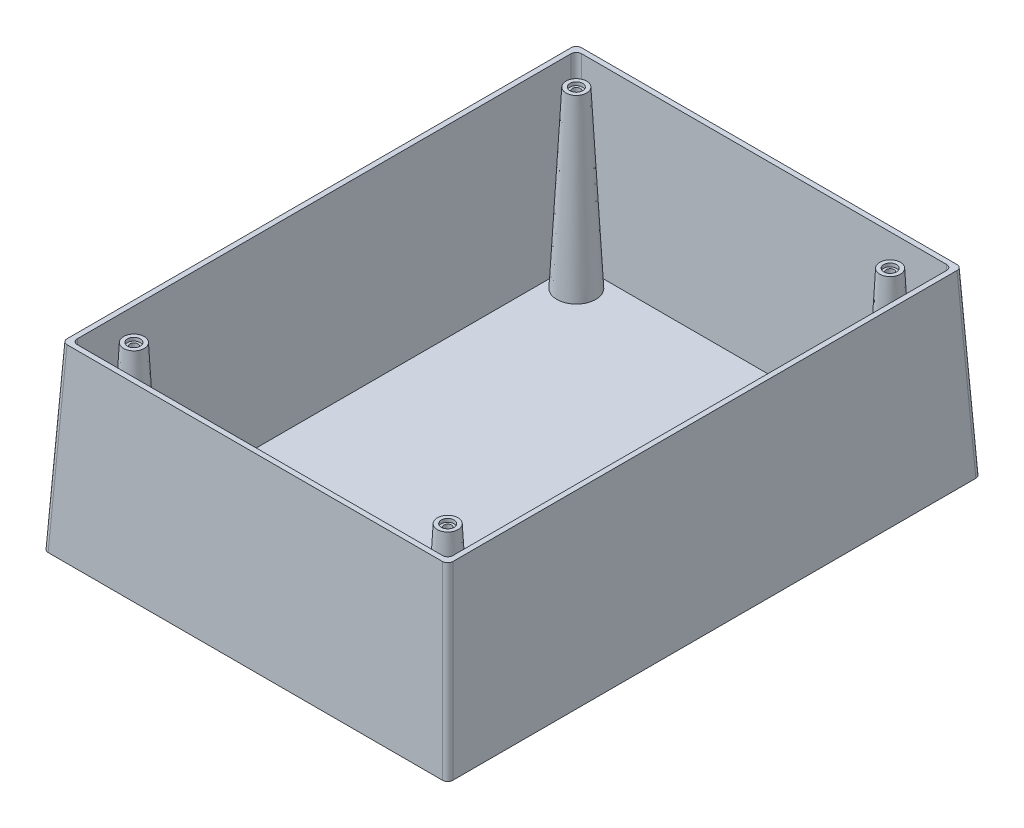
ISO-10303-21;
HEADER;
FILE_DESCRIPTION(('STEP AP214'),'2;1');
FILE_NAME('part.step','',(''),(''),'','','');
FILE_SCHEMA(('AUTOMOTIVE_DESIGN { 1 0 10303 214 1 1 1 1 }'));
ENDSEC;
DATA;
#1=APPLICATION_CONTEXT('core data for automotive mechanical design processes');
#2=APPLICATION_PROTOCOL_DEFINITION('international standard','automotive_design',2000,#1);
#3=PRODUCT_CONTEXT('',#1,'mechanical');
#4=PRODUCT('Part','Part','',(#3));
#5=PRODUCT_RELATED_PRODUCT_CATEGORY('part','',(#4));
#6=PRODUCT_DEFINITION_FORMATION('','',#4);
#7=PRODUCT_DEFINITION_CONTEXT('part definition',#1,'design');
#8=PRODUCT_DEFINITION('design','',#6,#7);
#9=PRODUCT_DEFINITION_SHAPE('','',#8);
#10=(LENGTH_UNIT() NAMED_UNIT(*) SI_UNIT(.MILLI.,.METRE.));
#11=(NAMED_UNIT(*) PLANE_ANGLE_UNIT() SI_UNIT($,.RADIAN.));
#12=(NAMED_UNIT(*) SI_UNIT($,.STERADIAN.) SOLID_ANGLE_UNIT());
#13=UNCERTAINTY_MEASURE_WITH_UNIT(LENGTH_MEASURE(1.E-05),#10,'distance_accuracy_value','');
#14=(GEOMETRIC_REPRESENTATION_CONTEXT(3) GLOBAL_UNCERTAINTY_ASSIGNED_CONTEXT((#13)) GLOBAL_UNIT_ASSIGNED_CONTEXT((#10,
#11,#12)) REPRESENTATION_CONTEXT('',''));
#15=CARTESIAN_POINT('',(0.,0.,0.));
#16=DIRECTION('',(0.,0.,1.));
#17=DIRECTION('',(1.,0.,0.));
#18=AXIS2_PLACEMENT_3D('',#15,#16,#17);
#19=CARTESIAN_POINT('',(75.,70.,-100.));
#20=DIRECTION('',(0.998629534754574,0.0523359562429439,0.));
#21=DIRECTION('',(-0.052335956242944,0.998629534754574,0.));
#22=AXIS2_PLACEMENT_3D('',#19,#20,#21);
#23=PLANE('',#22);
#24=DIRECTION('',(0.,0.,1.));
#25=VECTOR('',#24,1.);
#26=CARTESIAN_POINT('',(78.6685445498129,0.,-100.));
#27=LINE('',#26,#25);
#28=CARTESIAN_POINT('',(78.6685445498129,0.,101.671285480304));
#29=VERTEX_POINT('',#28);
#30=CARTESIAN_POINT('',(78.6685445498129,0.,-101.671285480304));
#31=VERTEX_POINT('',#30);
#32=EDGE_CURVE('E212',#29,#31,#27,.F.);
#33=ORIENTED_EDGE('',*,*,#32,.T.);
#34=DIRECTION('',(-0.052264427688714,0.997264688634237,0.0522644276887141));
#35=VECTOR('',#34,1.);
#36=CARTESIAN_POINT('',(75.0054556537586,69.8958999249102,-98.0081965842495));
#37=LINE('',#36,#35);
#38=CARTESIAN_POINT('',(75.,70.,-98.0027409304909));
#39=VERTEX_POINT('',#38);
#40=EDGE_CURVE('E289',#31,#39,#37,.T.);
#41=ORIENTED_EDGE('',*,*,#40,.T.);
#42=DIRECTION('',(0.,0.,-1.));
#43=VECTOR('',#42,1.);
#44=CARTESIAN_POINT('',(75.,70.,-100.));
#45=LINE('',#44,#43);
#46=CARTESIAN_POINT('',(75.,70.,98.0027409304908));
#47=VERTEX_POINT('',#46);
#48=EDGE_CURVE('E562',#47,#39,#45,.T.);
#49=ORIENTED_EDGE('',*,*,#48,.F.);
#50=DIRECTION('',(-0.052264427688714,0.997264688634237,-0.0522644276887141));
#51=VECTOR('',#50,1.);
#52=CARTESIAN_POINT('',(74.4591415734329,80.3201935660366,97.4618825039237));
#53=LINE('',#52,#51);
#54=EDGE_CURVE('E285',#47,#29,#53,.F.);
#55=ORIENTED_EDGE('',*,*,#54,.T.);
#56=EDGE_LOOP('',(#33,#41,#49,#55));
#57=FACE_BOUND('',#56,.T.);
#58=ADVANCED_FACE('F57',(#57),#23,.T.);
#59=CARTESIAN_POINT('',(-75.,70.,-100.));
#60=DIRECTION('',(0.,0.0523359562429439,-0.998629534754574));
#61=DIRECTION('',(0.,0.998629534754574,0.052335956242944));
#62=AXIS2_PLACEMENT_3D('',#59,#60,#61);
#63=PLANE('',#62);
#64=DIRECTION('',(1.,0.,0.));
#65=VECTOR('',#64,1.);
#66=CARTESIAN_POINT('',(-75.,0.,-103.668544549813));
#67=LINE('',#66,#65);
#68=CARTESIAN_POINT('',(76.6712854803037,0.,-103.668544549813));
#69=VERTEX_POINT('',#68);
#70=CARTESIAN_POINT('',(-76.6712854803038,0.,-103.668544549813));
#71=VERTEX_POINT('',#70);
#72=EDGE_CURVE('E533',#69,#71,#67,.F.);
#73=ORIENTED_EDGE('',*,*,#72,.T.);
#74=DIRECTION('',(0.0522644276887141,0.997264688634237,0.052264427688714));
#75=VECTOR('',#74,1.);
#76=CARTESIAN_POINT('',(-73.0081965842495,69.8958999249102,-100.005455653759));
#77=LINE('',#76,#75);
#78=CARTESIAN_POINT('',(-73.0027409304909,70.,-100.));
#79=VERTEX_POINT('',#78);
#80=EDGE_CURVE('E75',#71,#79,#77,.T.);
#81=ORIENTED_EDGE('',*,*,#80,.T.);
#82=DIRECTION('',(-1.,0.,0.));
#83=VECTOR('',#82,1.);
#84=CARTESIAN_POINT('',(-75.,70.,-100.));
#85=LINE('',#84,#83);
#86=CARTESIAN_POINT('',(73.0027409304909,70.,-100.));
#87=VERTEX_POINT('',#86);
#88=EDGE_CURVE('E547',#87,#79,#85,.T.);
#89=ORIENTED_EDGE('',*,*,#88,.F.);
#90=DIRECTION('',(-0.052264427688714,0.997264688634237,0.052264427688714));
#91=VECTOR('',#90,1.);
#92=CARTESIAN_POINT('',(72.5984610240052,77.714120155755,-99.5957200935144));
#93=LINE('',#92,#91);
#94=EDGE_CURVE('E279',#87,#69,#93,.F.);
#95=ORIENTED_EDGE('',*,*,#94,.T.);
#96=EDGE_LOOP('',(#73,#81,#89,#95));
#97=FACE_BOUND('',#96,.T.);
#98=ADVANCED_FACE('F409',(#97),#63,.T.);
#99=CARTESIAN_POINT('',(-75.,70.,-100.));
#100=DIRECTION('',(-0.998629534754574,0.0523359562429439,0.));
#101=DIRECTION('',(-0.052335956242944,-0.998629534754574,0.));
#102=AXIS2_PLACEMENT_3D('',#99,#100,#101);
#103=PLANE('',#102);
#104=DIRECTION('',(0.,0.,-1.));
#105=VECTOR('',#104,1.);
#106=CARTESIAN_POINT('',(-78.6685445498129,0.,-100.));
#107=LINE('',#106,#105);
#108=CARTESIAN_POINT('',(-78.6685445498129,0.,-101.671285480304));
#109=VERTEX_POINT('',#108);
#110=CARTESIAN_POINT('',(-78.6685445498129,0.,101.671285480304));
#111=VERTEX_POINT('',#110);
#112=EDGE_CURVE('E526',#109,#111,#107,.F.);
#113=ORIENTED_EDGE('',*,*,#112,.T.);
#114=DIRECTION('',(0.052264427688714,0.997264688634237,-0.052264427688714));
#115=VECTOR('',#114,1.);
#116=CARTESIAN_POINT('',(-74.4591415734329,80.3201935660366,97.4618825039237));
#117=LINE('',#116,#115);
#118=CARTESIAN_POINT('',(-75.,70.,98.0027409304908));
#119=VERTEX_POINT('',#118);
#120=EDGE_CURVE('E265',#111,#119,#117,.T.);
#121=ORIENTED_EDGE('',*,*,#120,.T.);
#122=DIRECTION('',(0.,0.,1.));
#123=VECTOR('',#122,1.);
#124=CARTESIAN_POINT('',(-75.,70.,-100.));
#125=LINE('',#124,#123);
#126=CARTESIAN_POINT('',(-75.,70.,-98.0027409304909));
#127=VERTEX_POINT('',#126);
#128=EDGE_CURVE('E540',#127,#119,#125,.T.);
#129=ORIENTED_EDGE('',*,*,#128,.F.);
#130=DIRECTION('',(0.0522644276887141,0.997264688634237,0.0522644276887141));
#131=VECTOR('',#130,1.);
#132=CARTESIAN_POINT('',(-75.0054556537587,69.8958999249102,-98.0081965842495));
#133=LINE('',#132,#131);
#134=EDGE_CURVE('E261',#127,#109,#133,.F.);
#135=ORIENTED_EDGE('',*,*,#134,.T.);
#136=EDGE_LOOP('',(#113,#121,#129,#135));
#137=FACE_BOUND('',#136,.T.);
#138=ADVANCED_FACE('F415',(#137),#103,.T.);
#139=CARTESIAN_POINT('',(-75.,70.,100.));
#140=DIRECTION('',(0.,0.0523359562429439,0.998629534754574));
#141=DIRECTION('',(0.,-0.998629534754574,0.052335956242944));
#142=AXIS2_PLACEMENT_3D('',#139,#140,#141);
#143=PLANE('',#142);
#144=DIRECTION('',(1.,0.,0.));
#145=VECTOR('',#144,1.);
#146=CARTESIAN_POINT('',(-75.,70.,100.));
#147=LINE('',#146,#145);
#148=CARTESIAN_POINT('',(-73.0027409304908,70.,100.));
#149=VERTEX_POINT('',#148);
#150=CARTESIAN_POINT('',(73.0027409304908,70.,100.));
#151=VERTEX_POINT('',#150);
#152=EDGE_CURVE('E305',#149,#151,#147,.T.);
#153=ORIENTED_EDGE('',*,*,#152,.F.);
#154=DIRECTION('',(0.052264427688714,0.997264688634237,-0.052264427688714));
#155=VECTOR('',#154,1.);
#156=CARTESIAN_POINT('',(-73.0081965842495,69.8958999249102,100.005455653759));
#157=LINE('',#156,#155);
#158=CARTESIAN_POINT('',(-76.6712854803037,0.,103.668544549813));
#159=VERTEX_POINT('',#158);
#160=EDGE_CURVE('E245',#149,#159,#157,.F.);
#161=ORIENTED_EDGE('',*,*,#160,.T.);
#162=DIRECTION('',(-1.,0.,0.));
#163=VECTOR('',#162,1.);
#164=CARTESIAN_POINT('',(-75.,0.,103.668544549813));
#165=LINE('',#164,#163);
#166=CARTESIAN_POINT('',(76.6712854803037,0.,103.668544549813));
#167=VERTEX_POINT('',#166);
#168=EDGE_CURVE('E532',#159,#167,#165,.F.);
#169=ORIENTED_EDGE('',*,*,#168,.T.);
#170=DIRECTION('',(-0.0522644276887141,0.997264688634237,-0.052264427688714));
#171=VECTOR('',#170,1.);
#172=CARTESIAN_POINT('',(72.5984610240052,77.714120155755,99.5957200935143));
#173=LINE('',#172,#171);
#174=EDGE_CURVE('E242',#167,#151,#173,.T.);
#175=ORIENTED_EDGE('',*,*,#174,.T.);
#176=EDGE_LOOP('',(#153,#161,#169,#175));
#177=FACE_BOUND('',#176,.T.);
#178=ADVANCED_FACE('F500',(#177),#143,.T.);
#179=CARTESIAN_POINT('',(0.,70.,0.));
#180=DIRECTION('',(0.,1.,0.));
#181=DIRECTION('',(0.,0.,1.));
#182=AXIS2_PLACEMENT_3D('',#179,#180,#181);
#183=PLANE('',#182);
#184=DIRECTION('',(0.,0.,-1.));
#185=VECTOR('',#184,1.);
#186=CARTESIAN_POINT('',(73.,70.,-100.));
#187=LINE('',#186,#185);
#188=CARTESIAN_POINT('',(73.,70.,96.0027409304908));
#189=VERTEX_POINT('',#188);
#190=CARTESIAN_POINT('',(73.,70.,-96.0027409304909));
#191=VERTEX_POINT('',#190);
#192=EDGE_CURVE('E560',#189,#191,#187,.T.);
#193=ORIENTED_EDGE('',*,*,#192,.F.);
#194=CARTESIAN_POINT('',(70.9972553080042,70.,95.9972553080041));
#195=DIRECTION('',(0.,1.,0.));
#196=DIRECTION('',(0.707106781186548,0.,0.707106781186547));
#197=AXIS2_PLACEMENT_3D('',#194,#195,#196);
#198=ELLIPSE('',#197,2.00548562763113,2.);
#199=CARTESIAN_POINT('',(71.0027409304908,70.,98.));
#200=VERTEX_POINT('',#199);
#201=EDGE_CURVE('E67',#189,#200,#198,.F.);
#202=ORIENTED_EDGE('',*,*,#201,.T.);
#203=DIRECTION('',(1.,0.,0.));
#204=VECTOR('',#203,1.);
#205=CARTESIAN_POINT('',(-75.,70.,98.));
#206=LINE('',#205,#204);
#207=CARTESIAN_POINT('',(-71.0027409304908,70.,98.));
#208=VERTEX_POINT('',#207);
#209=EDGE_CURVE('E566',#208,#200,#206,.T.);
#210=ORIENTED_EDGE('',*,*,#209,.F.);
#211=CARTESIAN_POINT('',(-70.9972553080041,70.,95.9972553080041));
#212=DIRECTION('',(0.,1.,0.));
#213=DIRECTION('',(-0.707106781186547,0.,0.707106781186548));
#214=AXIS2_PLACEMENT_3D('',#211,#212,#213);
#215=ELLIPSE('',#214,2.00548562763113,2.);
#216=CARTESIAN_POINT('',(-73.,70.,96.0027409304908));
#217=VERTEX_POINT('',#216);
#218=EDGE_CURVE('E12',#208,#217,#215,.F.);
#219=ORIENTED_EDGE('',*,*,#218,.T.);
#220=DIRECTION('',(0.,0.,1.));
#221=VECTOR('',#220,1.);
#222=CARTESIAN_POINT('',(-73.,70.,-100.));
#223=LINE('',#222,#221);
#224=CARTESIAN_POINT('',(-73.,70.,-96.0027409304909));
#225=VERTEX_POINT('',#224);
#226=EDGE_CURVE('E571',#225,#217,#223,.T.);
#227=ORIENTED_EDGE('',*,*,#226,.F.);
#228=CARTESIAN_POINT('',(-70.9972553080042,70.,-95.9972553080042));
#229=DIRECTION('',(0.,1.,0.));
#230=DIRECTION('',(-0.707106781186548,0.,-0.707106781186547));
#231=AXIS2_PLACEMENT_3D('',#228,#229,#230);
#232=ELLIPSE('',#231,2.00548562763113,2.);
#233=CARTESIAN_POINT('',(-71.0027409304909,70.,-98.));
#234=VERTEX_POINT('',#233);
#235=EDGE_CURVE('E295',#225,#234,#232,.F.);
#236=ORIENTED_EDGE('',*,*,#235,.T.);
#237=DIRECTION('',(-1.,0.,0.));
#238=VECTOR('',#237,1.);
#239=CARTESIAN_POINT('',(-75.,70.,-98.));
#240=LINE('',#239,#238);
#241=CARTESIAN_POINT('',(71.0027409304908,70.,-98.));
#242=VERTEX_POINT('',#241);
#243=EDGE_CURVE('E576',#242,#234,#240,.T.);
#244=ORIENTED_EDGE('',*,*,#243,.F.);
#245=CARTESIAN_POINT('',(70.9972553080041,70.,-95.9972553080042));
#246=DIRECTION('',(0.,1.,0.));
#247=DIRECTION('',(0.707106781186547,0.,-0.707106781186548));
#248=AXIS2_PLACEMENT_3D('',#245,#246,#247);
#249=ELLIPSE('',#248,2.00548562763113,2.);
#250=EDGE_CURVE('E292',#242,#191,#249,.F.);
#251=ORIENTED_EDGE('',*,*,#250,.T.);
#252=EDGE_LOOP('',(#193,#202,#210,#219,#227,#236,#244,#251));
#253=FACE_BOUND('',#252,.T.);
#254=ORIENTED_EDGE('',*,*,#128,.T.);
#255=CARTESIAN_POINT('',(-72.9972553080042,70.,97.9972553080041));
#256=DIRECTION('',(0.,1.,0.));
#257=DIRECTION('',(-0.707106781186547,0.,0.707106781186548));
#258=AXIS2_PLACEMENT_3D('',#255,#256,#257);
#259=ELLIPSE('',#258,2.00548562763113,2.);
#260=EDGE_CURVE('E276',#119,#149,#259,.T.);
#261=ORIENTED_EDGE('',*,*,#260,.T.);
#262=ORIENTED_EDGE('',*,*,#152,.T.);
#263=CARTESIAN_POINT('',(72.9972553080042,70.,97.9972553080041));
#264=DIRECTION('',(0.,1.,0.));
#265=DIRECTION('',(0.707106781186548,0.,0.707106781186547));
#266=AXIS2_PLACEMENT_3D('',#263,#264,#265);
#267=ELLIPSE('',#266,2.00548562763113,2.);
#268=EDGE_CURVE('E268',#151,#47,#267,.T.);
#269=ORIENTED_EDGE('',*,*,#268,.T.);
#270=ORIENTED_EDGE('',*,*,#48,.T.);
#271=CARTESIAN_POINT('',(72.9972553080042,70.,-97.9972553080042));
#272=DIRECTION('',(0.,1.,0.));
#273=DIRECTION('',(0.707106781186547,0.,-0.707106781186548));
#274=AXIS2_PLACEMENT_3D('',#271,#272,#273);
#275=ELLIPSE('',#274,2.00548562763113,2.);
#276=EDGE_CURVE('E82',#39,#87,#275,.T.);
#277=ORIENTED_EDGE('',*,*,#276,.T.);
#278=ORIENTED_EDGE('',*,*,#88,.T.);
#279=CARTESIAN_POINT('',(-72.9972553080042,70.,-97.9972553080042));
#280=DIRECTION('',(0.,1.,0.));
#281=DIRECTION('',(-0.707106781186548,0.,-0.707106781186547));
#282=AXIS2_PLACEMENT_3D('',#279,#280,#281);
#283=ELLIPSE('',#282,2.00548562763113,2.);
#284=EDGE_CURVE('E273',#79,#127,#283,.T.);
#285=ORIENTED_EDGE('',*,*,#284,.T.);
#286=EDGE_LOOP('',(#254,#261,#262,#269,#270,#277,#278,#285));
#287=FACE_BOUND('',#286,.T.);
#288=ADVANCED_FACE('F496',(#253,#287),#183,.T.);
#289=CARTESIAN_POINT('',(0.,0.,0.));
#290=DIRECTION('',(0.,1.,0.));
#291=DIRECTION('',(0.,0.,1.));
#292=AXIS2_PLACEMENT_3D('',#289,#290,#291);
#293=PLANE('',#292);
#294=ORIENTED_EDGE('',*,*,#168,.F.);
#295=CARTESIAN_POINT('',(-76.665799857817,0.,101.665799857817));
#296=DIRECTION('',(0.,1.,0.));
#297=DIRECTION('',(-0.707106781186547,0.,0.707106781186548));
#298=AXIS2_PLACEMENT_3D('',#295,#296,#297);
#299=ELLIPSE('',#298,2.00548562763113,2.);
#300=EDGE_CURVE('E258',#159,#111,#299,.F.);
#301=ORIENTED_EDGE('',*,*,#300,.T.);
#302=ORIENTED_EDGE('',*,*,#112,.F.);
#303=CARTESIAN_POINT('',(-76.6657998578171,0.,-101.665799857817));
#304=DIRECTION('',(0.,1.,0.));
#305=DIRECTION('',(-0.707106781186548,0.,-0.707106781186547));
#306=AXIS2_PLACEMENT_3D('',#303,#304,#305);
#307=ELLIPSE('',#306,2.00548562763113,2.);
#308=EDGE_CURVE('E255',#109,#71,#307,.F.);
#309=ORIENTED_EDGE('',*,*,#308,.T.);
#310=ORIENTED_EDGE('',*,*,#72,.F.);
#311=CARTESIAN_POINT('',(76.6657998578171,0.,-101.665799857817));
#312=DIRECTION('',(0.,1.,0.));
#313=DIRECTION('',(0.707106781186547,0.,-0.707106781186548));
#314=AXIS2_PLACEMENT_3D('',#311,#312,#313);
#315=ELLIPSE('',#314,2.00548562763113,2.);
#316=EDGE_CURVE('E252',#69,#31,#315,.F.);
#317=ORIENTED_EDGE('',*,*,#316,.T.);
#318=ORIENTED_EDGE('',*,*,#32,.F.);
#319=CARTESIAN_POINT('',(76.665799857817,0.,101.665799857817));
#320=DIRECTION('',(0.,1.,0.));
#321=DIRECTION('',(0.707106781186548,0.,0.707106781186547));
#322=AXIS2_PLACEMENT_3D('',#319,#320,#321);
#323=ELLIPSE('',#322,2.00548562763113,2.);
#324=EDGE_CURVE('E249',#29,#167,#323,.F.);
#325=ORIENTED_EDGE('',*,*,#324,.T.);
#326=EDGE_LOOP('',(#294,#301,#302,#309,#310,#317,#318,#325));
#327=FACE_BOUND('',#326,.T.);
#328=ADVANCED_FACE('F499',(#327),#293,.F.);
#329=CARTESIAN_POINT('',(73.,70.,-100.));
#330=DIRECTION('',(-0.998629534754574,0.0523359562429439,0.));
#331=DIRECTION('',(-0.052335956242944,-0.998629534754574,0.));
#332=AXIS2_PLACEMENT_3D('',#329,#330,#331);
#333=PLANE('',#332);
#334=ORIENTED_EDGE('',*,*,#192,.T.);
#335=DIRECTION('',(-0.052264427688714,-0.997264688634237,0.0522644276887141));
#336=VECTOR('',#335,1.);
#337=CARTESIAN_POINT('',(69.4417266625118,2.10410007508983,-92.4444675930027));
#338=LINE('',#337,#336);
#339=CARTESIAN_POINT('',(69.4362710087532,2.,-92.4390119392441));
#340=VERTEX_POINT('',#339);
#341=EDGE_CURVE('E195',#191,#340,#338,.T.);
#342=ORIENTED_EDGE('',*,*,#341,.T.);
#343=DIRECTION('',(0.,0.,-1.));
#344=VECTOR('',#343,1.);
#345=CARTESIAN_POINT('',(69.4362710087532,2.,-100.));
#346=LINE('',#345,#344);
#347=CARTESIAN_POINT('',(69.4362710087532,2.,92.439011939244));
#348=VERTEX_POINT('',#347);
#349=EDGE_CURVE('E177',#348,#340,#346,.T.);
#350=ORIENTED_EDGE('',*,*,#349,.F.);
#351=DIRECTION('',(-0.052264427688714,-0.997264688634237,-0.0522644276887141));
#352=VECTOR('',#351,1.);
#353=CARTESIAN_POINT('',(73.0054556537587,70.1041000750898,96.0081965842495));
#354=LINE('',#353,#352);
#355=EDGE_CURVE('E192',#348,#189,#354,.F.);
#356=ORIENTED_EDGE('',*,*,#355,.T.);
#357=EDGE_LOOP('',(#334,#342,#350,#356));
#358=FACE_BOUND('',#357,.T.);
#359=ADVANCED_FACE('F191',(#358),#333,.T.);
#360=CARTESIAN_POINT('',(-75.,70.,-98.));
#361=DIRECTION('',(0.,0.0523359562429439,0.998629534754574));
#362=DIRECTION('',(0.,-0.998629534754574,0.052335956242944));
#363=AXIS2_PLACEMENT_3D('',#360,#361,#362);
#364=PLANE('',#363);
#365=DIRECTION('',(-1.,0.,0.));
#366=VECTOR('',#365,1.);
#367=CARTESIAN_POINT('',(-75.,2.,-94.4362710087532));
#368=LINE('',#367,#366);
#369=CARTESIAN_POINT('',(67.439011939244,2.,-94.4362710087532));
#370=VERTEX_POINT('',#369);
#371=CARTESIAN_POINT('',(-67.4390119392441,2.,-94.4362710087532));
#372=VERTEX_POINT('',#371);
#373=EDGE_CURVE('E197',#370,#372,#368,.T.);
#374=ORIENTED_EDGE('',*,*,#373,.F.);
#375=DIRECTION('',(-0.052264427688714,-0.997264688634237,0.052264427688714));
#376=VECTOR('',#375,1.);
#377=CARTESIAN_POINT('',(71.0081965842495,70.1041000750898,-98.0054556537587));
#378=LINE('',#377,#376);
#379=EDGE_CURVE('E226',#370,#242,#378,.F.);
#380=ORIENTED_EDGE('',*,*,#379,.T.);
#381=ORIENTED_EDGE('',*,*,#243,.T.);
#382=DIRECTION('',(0.0522644276887141,-0.997264688634237,0.052264427688714));
#383=VECTOR('',#382,1.);
#384=CARTESIAN_POINT('',(-67.4444675930027,2.10410007508983,-94.4417266625119));
#385=LINE('',#384,#383);
#386=EDGE_CURVE('E222',#234,#372,#385,.T.);
#387=ORIENTED_EDGE('',*,*,#386,.T.);
#388=EDGE_LOOP('',(#374,#380,#381,#387));
#389=FACE_BOUND('',#388,.T.);
#390=ADVANCED_FACE('F507',(#389),#364,.T.);
#391=CARTESIAN_POINT('',(-73.,70.,-100.));
#392=DIRECTION('',(0.998629534754574,0.0523359562429439,0.));
#393=DIRECTION('',(-0.052335956242944,0.998629534754574,0.));
#394=AXIS2_PLACEMENT_3D('',#391,#392,#393);
#395=PLANE('',#394);
#396=DIRECTION('',(0.,0.,1.));
#397=VECTOR('',#396,1.);
#398=CARTESIAN_POINT('',(-69.4362710087532,2.,-100.));
#399=LINE('',#398,#397);
#400=CARTESIAN_POINT('',(-69.4362710087532,2.,-92.4390119392441));
#401=VERTEX_POINT('',#400);
#402=CARTESIAN_POINT('',(-69.4362710087532,2.,92.439011939244));
#403=VERTEX_POINT('',#402);
#404=EDGE_CURVE('E554',#401,#403,#399,.T.);
#405=ORIENTED_EDGE('',*,*,#404,.F.);
#406=DIRECTION('',(0.0522644276887141,-0.997264688634237,0.0522644276887141));
#407=VECTOR('',#406,1.);
#408=CARTESIAN_POINT('',(-73.0054556537587,70.1041000750898,-96.0081965842495));
#409=LINE('',#408,#407);
#410=EDGE_CURVE('E233',#401,#225,#409,.F.);
#411=ORIENTED_EDGE('',*,*,#410,.T.);
#412=ORIENTED_EDGE('',*,*,#226,.T.);
#413=DIRECTION('',(0.052264427688714,-0.997264688634237,-0.052264427688714));
#414=VECTOR('',#413,1.);
#415=CARTESIAN_POINT('',(-69.4417266625118,2.10410007508984,92.4444675930027));
#416=LINE('',#415,#414);
#417=EDGE_CURVE('E229',#217,#403,#416,.T.);
#418=ORIENTED_EDGE('',*,*,#417,.T.);
#419=EDGE_LOOP('',(#405,#411,#412,#418));
#420=FACE_BOUND('',#419,.T.);
#421=ADVANCED_FACE('F510',(#420),#395,.T.);
#422=CARTESIAN_POINT('',(-75.,70.,98.));
#423=DIRECTION('',(0.,0.0523359562429439,-0.998629534754574));
#424=DIRECTION('',(0.,0.998629534754574,0.052335956242944));
#425=AXIS2_PLACEMENT_3D('',#422,#423,#424);
#426=PLANE('',#425);
#427=ORIENTED_EDGE('',*,*,#209,.T.);
#428=DIRECTION('',(-0.0522644276887141,-0.997264688634237,-0.052264427688714));
#429=VECTOR('',#428,1.);
#430=CARTESIAN_POINT('',(67.4444675930027,2.10410007508983,94.4417266625118));
#431=LINE('',#430,#429);
#432=CARTESIAN_POINT('',(67.439011939244,2.,94.4362710087532));
#433=VERTEX_POINT('',#432);
#434=EDGE_CURVE('E239',#200,#433,#431,.T.);
#435=ORIENTED_EDGE('',*,*,#434,.T.);
#436=DIRECTION('',(1.,0.,0.));
#437=VECTOR('',#436,1.);
#438=CARTESIAN_POINT('',(-75.,2.,94.4362710087532));
#439=LINE('',#438,#437);
#440=CARTESIAN_POINT('',(-67.439011939244,2.,94.4362710087532));
#441=VERTEX_POINT('',#440);
#442=EDGE_CURVE('E179',#441,#433,#439,.T.);
#443=ORIENTED_EDGE('',*,*,#442,.F.);
#444=DIRECTION('',(0.052264427688714,-0.997264688634237,-0.052264427688714));
#445=VECTOR('',#444,1.);
#446=CARTESIAN_POINT('',(-71.0081965842495,70.1041000750898,98.0054556537586));
#447=LINE('',#446,#445);
#448=EDGE_CURVE('E236',#441,#208,#447,.F.);
#449=ORIENTED_EDGE('',*,*,#448,.T.);
#450=EDGE_LOOP('',(#427,#435,#443,#449));
#451=FACE_BOUND('',#450,.T.);
#452=ADVANCED_FACE('F492',(#451),#426,.T.);
#453=CARTESIAN_POINT('',(0.,2.,0.));
#454=DIRECTION('',(0.,1.,0.));
#455=DIRECTION('',(0.,0.,1.));
#456=AXIS2_PLACEMENT_3D('',#453,#454,#455);
#457=PLANE('',#456);
#458=CARTESIAN_POINT('',(61.,2.,86.));
#459=DIRECTION('',(0.,1.,0.));
#460=DIRECTION('',(0.,0.,1.));
#461=AXIS2_PLACEMENT_3D('',#458,#459,#460);
#462=CIRCLE('',#461,7.55485700579188);
#463=CARTESIAN_POINT('',(61.,2.,93.5548570057919));
#464=VERTEX_POINT('',#463);
#465=EDGE_CURVE('E203',#464,#464,#462,.T.);
#466=ORIENTED_EDGE('',*,*,#465,.F.);
#467=EDGE_LOOP('',(#466));
#468=FACE_BOUND('',#467,.T.);
#469=CARTESIAN_POINT('',(-61.,2.,86.));
#470=DIRECTION('',(0.,1.,0.));
#471=DIRECTION('',(0.,0.,1.));
#472=AXIS2_PLACEMENT_3D('',#469,#470,#471);
#473=CIRCLE('',#472,7.55485700579188);
#474=CARTESIAN_POINT('',(-61.,2.,93.5548570057919));
#475=VERTEX_POINT('',#474);
#476=EDGE_CURVE('E209',#475,#475,#473,.T.);
#477=ORIENTED_EDGE('',*,*,#476,.F.);
#478=EDGE_LOOP('',(#477));
#479=FACE_BOUND('',#478,.T.);
#480=CARTESIAN_POINT('',(61.,2.,-86.));
#481=DIRECTION('',(0.,1.,0.));
#482=DIRECTION('',(0.,0.,1.));
#483=AXIS2_PLACEMENT_3D('',#480,#481,#482);
#484=CIRCLE('',#483,7.55485700579188);
#485=CARTESIAN_POINT('',(61.,2.,-78.4451429942081));
#486=VERTEX_POINT('',#485);
#487=EDGE_CURVE('E304',#486,#486,#484,.T.);
#488=ORIENTED_EDGE('',*,*,#487,.F.);
#489=EDGE_LOOP('',(#488));
#490=FACE_BOUND('',#489,.T.);
#491=CARTESIAN_POINT('',(-61.,2.,-86.));
#492=DIRECTION('',(0.,1.,0.));
#493=DIRECTION('',(0.,0.,1.));
#494=AXIS2_PLACEMENT_3D('',#491,#492,#493);
#495=CIRCLE('',#494,7.55485700579188);
#496=CARTESIAN_POINT('',(-61.,2.,-78.4451429942082));
#497=VERTEX_POINT('',#496);
#498=EDGE_CURVE('E300',#497,#497,#495,.T.);
#499=ORIENTED_EDGE('',*,*,#498,.F.);
#500=EDGE_LOOP('',(#499));
#501=FACE_BOUND('',#500,.T.);
#502=ORIENTED_EDGE('',*,*,#349,.T.);
#503=CARTESIAN_POINT('',(67.4335263167573,2.,-92.4335263167574));
#504=DIRECTION('',(0.,1.,0.));
#505=DIRECTION('',(0.707106781186547,0.,-0.707106781186548));
#506=AXIS2_PLACEMENT_3D('',#503,#504,#505);
#507=ELLIPSE('',#506,2.00548562763113,2.);
#508=EDGE_CURVE('E219',#340,#370,#507,.T.);
#509=ORIENTED_EDGE('',*,*,#508,.T.);
#510=ORIENTED_EDGE('',*,*,#373,.T.);
#511=CARTESIAN_POINT('',(-67.4335263167574,2.,-92.4335263167574));
#512=DIRECTION('',(0.,1.,0.));
#513=DIRECTION('',(-0.707106781186548,0.,-0.707106781186547));
#514=AXIS2_PLACEMENT_3D('',#511,#512,#513);
#515=ELLIPSE('',#514,2.00548562763113,2.);
#516=EDGE_CURVE('E185',#372,#401,#515,.T.);
#517=ORIENTED_EDGE('',*,*,#516,.T.);
#518=ORIENTED_EDGE('',*,*,#404,.T.);
#519=CARTESIAN_POINT('',(-67.4335263167573,2.,92.4335263167573));
#520=DIRECTION('',(0.,1.,0.));
#521=DIRECTION('',(-0.707106781186547,0.,0.707106781186548));
#522=AXIS2_PLACEMENT_3D('',#519,#520,#521);
#523=ELLIPSE('',#522,2.00548562763113,2.);
#524=EDGE_CURVE('E186',#403,#441,#523,.T.);
#525=ORIENTED_EDGE('',*,*,#524,.T.);
#526=ORIENTED_EDGE('',*,*,#442,.T.);
#527=CARTESIAN_POINT('',(67.4335263167574,2.,92.4335263167573));
#528=DIRECTION('',(0.,1.,0.));
#529=DIRECTION('',(0.707106781186548,0.,0.707106781186547));
#530=AXIS2_PLACEMENT_3D('',#527,#528,#529);
#531=ELLIPSE('',#530,2.00548562763113,2.);
#532=EDGE_CURVE('E174',#433,#348,#531,.T.);
#533=ORIENTED_EDGE('',*,*,#532,.T.);
#534=EDGE_LOOP('',(#502,#509,#510,#517,#518,#525,#526,#533));
#535=FACE_BOUND('',#534,.T.);
#536=ADVANCED_FACE('F176',(#468,#479,#490,#501,#535),#457,.T.);
#537=CARTESIAN_POINT('',(-61.,69.7460000000001,-86.));
#538=DIRECTION('',(0.,1.,0.));
#539=DIRECTION('',(0.948683298050514,0.,-0.316227766016838));
#540=AXIS2_PLACEMENT_3D('',#537,#538,#539);
#541=PLANE('',#540);
#542=CARTESIAN_POINT('',(-61.,69.7460000000001,-86.));
#543=DIRECTION('',(0.,1.,0.));
#544=DIRECTION('',(0.,0.,1.));
#545=AXIS2_PLACEMENT_3D('',#542,#543,#544);
#546=CIRCLE('',#545,2.48668842406211);
#547=CARTESIAN_POINT('',(-61.,69.7460000000001,-83.5133115759379));
#548=VERTEX_POINT('',#547);
#549=EDGE_CURVE('E308',#548,#548,#546,.T.);
#550=ORIENTED_EDGE('',*,*,#549,.F.);
#551=EDGE_LOOP('',(#550));
#552=FACE_BOUND('',#551,.T.);
#553=CARTESIAN_POINT('',(-61.,69.7460000000001,-86.));
#554=DIRECTION('',(0.,1.,0.));
#555=DIRECTION('',(0.,0.,1.));
#556=AXIS2_PLACEMENT_3D('',#553,#554,#555);
#557=CIRCLE('',#556,4.00443959048295);
#558=CARTESIAN_POINT('',(-61.,69.7460000000001,-81.9955604095171));
#559=VERTEX_POINT('',#558);
#560=EDGE_CURVE('E198',#559,#559,#557,.F.);
#561=ORIENTED_EDGE('',*,*,#560,.F.);
#562=EDGE_LOOP('',(#561));
#563=FACE_BOUND('',#562,.T.);
#564=ADVANCED_FACE('F453',(#552,#563),#541,.T.);
#565=CARTESIAN_POINT('',(-61.,70.,-86.));
#566=DIRECTION('',(0.,-1.,0.));
#567=DIRECTION('',(0.,0.,1.));
#568=AXIS2_PLACEMENT_3D('',#565,#566,#567);
#569=CONICAL_SURFACE('',#568,3.99112801454507,0.05235987755983);
#570=ORIENTED_EDGE('',*,*,#498,.T.);
#571=EDGE_LOOP('',(#570));
#572=FACE_BOUND('',#571,.T.);
#573=ORIENTED_EDGE('',*,*,#560,.T.);
#574=EDGE_LOOP('',(#573));
#575=FACE_BOUND('',#574,.T.);
#576=ADVANCED_FACE('F404',(#572,#575),#569,.T.);
#577=CARTESIAN_POINT('',(-61.,60.,-86.));
#578=DIRECTION('',(0.,-1.,0.));
#579=DIRECTION('',(-0.948683298050514,0.,0.316227766016838));
#580=AXIS2_PLACEMENT_3D('',#577,#578,#579);
#581=PLANE('',#580);
#582=CARTESIAN_POINT('',(-61.,60.,-86.));
#583=DIRECTION('',(0.,-1.,0.));
#584=DIRECTION('',(0.,0.,-1.));
#585=AXIS2_PLACEMENT_3D('',#582,#583,#584);
#586=CIRCLE('',#585,1.10210480456191);
#587=CARTESIAN_POINT('',(-61.,60.,-87.1021048045619));
#588=VERTEX_POINT('',#587);
#589=EDGE_CURVE('E61',#588,#588,#586,.F.);
#590=ORIENTED_EDGE('',*,*,#589,.T.);
#591=EDGE_LOOP('',(#590));
#592=FACE_BOUND('',#591,.T.);
#593=ADVANCED_FACE('F391',(#592),#581,.F.);
#594=CARTESIAN_POINT('',(-61.,70.,-86.));
#595=DIRECTION('',(0.,1.,0.));
#596=DIRECTION('',(0.,0.,1.));
#597=AXIS2_PLACEMENT_3D('',#594,#595,#596);
#598=CONICAL_SURFACE('',#597,1.62618259739233,0.05235987755983);
#599=CARTESIAN_POINT('',(-61.,68.5,-86.));
#600=DIRECTION('',(0.,-1.,0.));
#601=DIRECTION('',(0.,0.,-1.));
#602=AXIS2_PLACEMENT_3D('',#599,#600,#601);
#603=CIRCLE('',#602,1.54757092846776);
#604=CARTESIAN_POINT('',(-61.,68.5,-87.5475709284678));
#605=VERTEX_POINT('',#604);
#606=EDGE_CURVE('E340',#605,#605,#603,.F.);
#607=ORIENTED_EDGE('',*,*,#606,.T.);
#608=EDGE_LOOP('',(#607));
#609=FACE_BOUND('',#608,.T.);
#610=ORIENTED_EDGE('',*,*,#589,.F.);
#611=EDGE_LOOP('',(#610));
#612=FACE_BOUND('',#611,.T.);
#613=ADVANCED_FACE('F393',(#609,#612),#598,.F.);
#614=CARTESIAN_POINT('',(-61.,68.5,-86.));
#615=DIRECTION('',(0.,-1.,0.));
#616=DIRECTION('',(-0.948683298050514,0.,0.316227766016838));
#617=AXIS2_PLACEMENT_3D('',#614,#615,#616);
#618=PLANE('',#617);
#619=ORIENTED_EDGE('',*,*,#606,.F.);
#620=EDGE_LOOP('',(#619));
#621=FACE_BOUND('',#620,.T.);
#622=CARTESIAN_POINT('',(-61.,68.5,-86.));
#623=DIRECTION('',(0.,-1.,0.));
#624=DIRECTION('',(0.,0.,-1.));
#625=AXIS2_PLACEMENT_3D('',#622,#623,#624);
#626=CIRCLE('',#625,2.42138833107544);
#627=CARTESIAN_POINT('',(-61.,68.5,-88.4213883310755));
#628=VERTEX_POINT('',#627);
#629=EDGE_CURVE('E323',#628,#628,#626,.F.);
#630=ORIENTED_EDGE('',*,*,#629,.T.);
#631=EDGE_LOOP('',(#630));
#632=FACE_BOUND('',#631,.T.);
#633=ADVANCED_FACE('F395',(#621,#632),#618,.F.);
#634=CARTESIAN_POINT('',(-61.,70.,-86.));
#635=DIRECTION('',(0.,1.,0.));
#636=DIRECTION('',(0.,0.,1.));
#637=AXIS2_PLACEMENT_3D('',#634,#635,#636);
#638=CONICAL_SURFACE('',#637,2.5,0.05235987755983);
#639=ORIENTED_EDGE('',*,*,#549,.T.);
#640=EDGE_LOOP('',(#639));
#641=FACE_BOUND('',#640,.T.);
#642=ORIENTED_EDGE('',*,*,#629,.F.);
#643=EDGE_LOOP('',(#642));
#644=FACE_BOUND('',#643,.T.);
#645=ADVANCED_FACE('F401',(#641,#644),#638,.F.);
#646=CARTESIAN_POINT('',(61.,69.7460000000001,-86.));
#647=DIRECTION('',(0.,1.,0.));
#648=DIRECTION('',(0.948683298050514,0.,-0.316227766016838));
#649=AXIS2_PLACEMENT_3D('',#646,#647,#648);
#650=PLANE('',#649);
#651=CARTESIAN_POINT('',(61.,69.7460000000001,-86.));
#652=DIRECTION('',(0.,1.,0.));
#653=DIRECTION('',(0.,0.,1.));
#654=AXIS2_PLACEMENT_3D('',#651,#652,#653);
#655=CIRCLE('',#654,2.48668842406211);
#656=CARTESIAN_POINT('',(61.,69.7460000000001,-83.5133115759379));
#657=VERTEX_POINT('',#656);
#658=EDGE_CURVE('E324',#657,#657,#655,.T.);
#659=ORIENTED_EDGE('',*,*,#658,.F.);
#660=EDGE_LOOP('',(#659));
#661=FACE_BOUND('',#660,.T.);
#662=CARTESIAN_POINT('',(61.,69.7460000000001,-86.));
#663=DIRECTION('',(0.,1.,0.));
#664=DIRECTION('',(0.,0.,1.));
#665=AXIS2_PLACEMENT_3D('',#662,#663,#664);
#666=CIRCLE('',#665,4.00443959048295);
#667=CARTESIAN_POINT('',(61.,69.7460000000001,-81.9955604095171));
#668=VERTEX_POINT('',#667);
#669=EDGE_CURVE('E319',#668,#668,#666,.F.);
#670=ORIENTED_EDGE('',*,*,#669,.F.);
#671=EDGE_LOOP('',(#670));
#672=FACE_BOUND('',#671,.T.);
#673=ADVANCED_FACE('F465',(#661,#672),#650,.T.);
#674=CARTESIAN_POINT('',(61.,70.,-86.));
#675=DIRECTION('',(0.,-1.,0.));
#676=DIRECTION('',(0.,0.,1.));
#677=AXIS2_PLACEMENT_3D('',#674,#675,#676);
#678=CONICAL_SURFACE('',#677,3.99112801454507,0.05235987755983);
#679=ORIENTED_EDGE('',*,*,#487,.T.);
#680=EDGE_LOOP('',(#679));
#681=FACE_BOUND('',#680,.T.);
#682=ORIENTED_EDGE('',*,*,#669,.T.);
#683=EDGE_LOOP('',(#682));
#684=FACE_BOUND('',#683,.T.);
#685=ADVANCED_FACE('F461',(#681,#684),#678,.T.);
#686=CARTESIAN_POINT('',(61.,60.,-86.));
#687=DIRECTION('',(0.,-1.,0.));
#688=DIRECTION('',(-0.948683298050514,0.,0.316227766016838));
#689=AXIS2_PLACEMENT_3D('',#686,#687,#688);
#690=PLANE('',#689);
#691=CARTESIAN_POINT('',(61.,60.,-86.));
#692=DIRECTION('',(0.,-1.,0.));
#693=DIRECTION('',(0.,0.,-1.));
#694=AXIS2_PLACEMENT_3D('',#691,#692,#693);
#695=CIRCLE('',#694,1.10210480456191);
#696=CARTESIAN_POINT('',(61.,60.,-87.1021048045619));
#697=VERTEX_POINT('',#696);
#698=EDGE_CURVE('E344',#697,#697,#695,.F.);
#699=ORIENTED_EDGE('',*,*,#698,.T.);
#700=EDGE_LOOP('',(#699));
#701=FACE_BOUND('',#700,.T.);
#702=ADVANCED_FACE('F464',(#701),#690,.F.);
#703=CARTESIAN_POINT('',(61.,70.,-86.));
#704=DIRECTION('',(0.,1.,0.));
#705=DIRECTION('',(0.,0.,1.));
#706=AXIS2_PLACEMENT_3D('',#703,#704,#705);
#707=CONICAL_SURFACE('',#706,1.62618259739233,0.05235987755983);
#708=CARTESIAN_POINT('',(61.,68.5,-86.));
#709=DIRECTION('',(0.,-1.,0.));
#710=DIRECTION('',(0.,0.,-1.));
#711=AXIS2_PLACEMENT_3D('',#708,#709,#710);
#712=CIRCLE('',#711,1.54757092846776);
#713=CARTESIAN_POINT('',(61.,68.5,-87.5475709284678));
#714=VERTEX_POINT('',#713);
#715=EDGE_CURVE('E348',#714,#714,#712,.F.);
#716=ORIENTED_EDGE('',*,*,#715,.T.);
#717=EDGE_LOOP('',(#716));
#718=FACE_BOUND('',#717,.T.);
#719=ORIENTED_EDGE('',*,*,#698,.F.);
#720=EDGE_LOOP('',(#719));
#721=FACE_BOUND('',#720,.T.);
#722=ADVANCED_FACE('F713',(#718,#721),#707,.F.);
#723=CARTESIAN_POINT('',(61.,68.5,-86.));
#724=DIRECTION('',(0.,-1.,0.));
#725=DIRECTION('',(-0.948683298050514,0.,0.316227766016838));
#726=AXIS2_PLACEMENT_3D('',#723,#724,#725);
#727=PLANE('',#726);
#728=ORIENTED_EDGE('',*,*,#715,.F.);
#729=EDGE_LOOP('',(#728));
#730=FACE_BOUND('',#729,.T.);
#731=CARTESIAN_POINT('',(61.,68.5,-86.));
#732=DIRECTION('',(0.,-1.,0.));
#733=DIRECTION('',(0.,0.,-1.));
#734=AXIS2_PLACEMENT_3D('',#731,#732,#733);
#735=CIRCLE('',#734,2.42138833107544);
#736=CARTESIAN_POINT('',(61.,68.5,-88.4213883310755));
#737=VERTEX_POINT('',#736);
#738=EDGE_CURVE('E332',#737,#737,#735,.F.);
#739=ORIENTED_EDGE('',*,*,#738,.T.);
#740=EDGE_LOOP('',(#739));
#741=FACE_BOUND('',#740,.T.);
#742=ADVANCED_FACE('F723',(#730,#741),#727,.F.);
#743=CARTESIAN_POINT('',(61.,70.,-86.));
#744=DIRECTION('',(0.,1.,0.));
#745=DIRECTION('',(0.,0.,1.));
#746=AXIS2_PLACEMENT_3D('',#743,#744,#745);
#747=CONICAL_SURFACE('',#746,2.5,0.05235987755983);
#748=ORIENTED_EDGE('',*,*,#658,.T.);
#749=EDGE_LOOP('',(#748));
#750=FACE_BOUND('',#749,.T.);
#751=ORIENTED_EDGE('',*,*,#738,.F.);
#752=EDGE_LOOP('',(#751));
#753=FACE_BOUND('',#752,.T.);
#754=ADVANCED_FACE('F59',(#750,#753),#747,.F.);
#755=CARTESIAN_POINT('',(-61.,69.7460000000001,86.));
#756=DIRECTION('',(0.,1.,0.));
#757=DIRECTION('',(0.948683298050514,0.,-0.316227766016838));
#758=AXIS2_PLACEMENT_3D('',#755,#756,#757);
#759=PLANE('',#758);
#760=CARTESIAN_POINT('',(-61.,69.7460000000001,86.));
#761=DIRECTION('',(0.,1.,0.));
#762=DIRECTION('',(0.,0.,1.));
#763=AXIS2_PLACEMENT_3D('',#760,#761,#762);
#764=CIRCLE('',#763,2.48668842406211);
#765=CARTESIAN_POINT('',(-61.,69.7460000000001,88.4866884240621));
#766=VERTEX_POINT('',#765);
#767=EDGE_CURVE('E333',#766,#766,#764,.T.);
#768=ORIENTED_EDGE('',*,*,#767,.F.);
#769=EDGE_LOOP('',(#768));
#770=FACE_BOUND('',#769,.T.);
#771=CARTESIAN_POINT('',(-61.,69.7460000000001,86.));
#772=DIRECTION('',(0.,1.,0.));
#773=DIRECTION('',(0.,0.,1.));
#774=AXIS2_PLACEMENT_3D('',#771,#772,#773);
#775=CIRCLE('',#774,4.00443959048295);
#776=CARTESIAN_POINT('',(-61.,69.7460000000001,90.0044395904829));
#777=VERTEX_POINT('',#776);
#778=EDGE_CURVE('E328',#777,#777,#775,.F.);
#779=ORIENTED_EDGE('',*,*,#778,.F.);
#780=EDGE_LOOP('',(#779));
#781=FACE_BOUND('',#780,.T.);
#782=ADVANCED_FACE('F459',(#770,#781),#759,.T.);
#783=CARTESIAN_POINT('',(-61.,70.,86.));
#784=DIRECTION('',(0.,-1.,0.));
#785=DIRECTION('',(0.,0.,1.));
#786=AXIS2_PLACEMENT_3D('',#783,#784,#785);
#787=CONICAL_SURFACE('',#786,3.99112801454507,0.05235987755983);
#788=ORIENTED_EDGE('',*,*,#476,.T.);
#789=EDGE_LOOP('',(#788));
#790=FACE_BOUND('',#789,.T.);
#791=ORIENTED_EDGE('',*,*,#778,.T.);
#792=EDGE_LOOP('',(#791));
#793=FACE_BOUND('',#792,.T.);
#794=ADVANCED_FACE('F455',(#790,#793),#787,.T.);
#795=CARTESIAN_POINT('',(-61.,60.,86.));
#796=DIRECTION('',(0.,-1.,0.));
#797=DIRECTION('',(-0.948683298050514,0.,0.316227766016838));
#798=AXIS2_PLACEMENT_3D('',#795,#796,#797);
#799=PLANE('',#798);
#800=CARTESIAN_POINT('',(-61.,60.,86.));
#801=DIRECTION('',(0.,-1.,0.));
#802=DIRECTION('',(0.,0.,-1.));
#803=AXIS2_PLACEMENT_3D('',#800,#801,#802);
#804=CIRCLE('',#803,1.10210480456191);
#805=CARTESIAN_POINT('',(-61.,60.,84.8978951954381));
#806=VERTEX_POINT('',#805);
#807=EDGE_CURVE('E374',#806,#806,#804,.F.);
#808=ORIENTED_EDGE('',*,*,#807,.T.);
#809=EDGE_LOOP('',(#808));
#810=FACE_BOUND('',#809,.T.);
#811=ADVANCED_FACE('F458',(#810),#799,.F.);
#812=CARTESIAN_POINT('',(-61.,70.,86.));
#813=DIRECTION('',(0.,1.,0.));
#814=DIRECTION('',(0.,0.,1.));
#815=AXIS2_PLACEMENT_3D('',#812,#813,#814);
#816=CONICAL_SURFACE('',#815,1.62618259739233,0.05235987755983);
#817=CARTESIAN_POINT('',(-61.,68.5,86.));
#818=DIRECTION('',(0.,-1.,0.));
#819=DIRECTION('',(0.,0.,-1.));
#820=AXIS2_PLACEMENT_3D('',#817,#818,#819);
#821=CIRCLE('',#820,1.54757092846776);
#822=CARTESIAN_POINT('',(-61.,68.5,84.4524290715322));
#823=VERTEX_POINT('',#822);
#824=EDGE_CURVE('E370',#823,#823,#821,.F.);
#825=ORIENTED_EDGE('',*,*,#824,.T.);
#826=EDGE_LOOP('',(#825));
#827=FACE_BOUND('',#826,.T.);
#828=ORIENTED_EDGE('',*,*,#807,.F.);
#829=EDGE_LOOP('',(#828));
#830=FACE_BOUND('',#829,.T.);
#831=ADVANCED_FACE('F754',(#827,#830),#816,.F.);
#832=CARTESIAN_POINT('',(-61.,68.5,86.));
#833=DIRECTION('',(0.,-1.,0.));
#834=DIRECTION('',(-0.948683298050514,0.,0.316227766016838));
#835=AXIS2_PLACEMENT_3D('',#832,#833,#834);
#836=PLANE('',#835);
#837=ORIENTED_EDGE('',*,*,#824,.F.);
#838=EDGE_LOOP('',(#837));
#839=FACE_BOUND('',#838,.T.);
#840=CARTESIAN_POINT('',(-61.,68.5,86.));
#841=DIRECTION('',(0.,-1.,0.));
#842=DIRECTION('',(0.,0.,-1.));
#843=AXIS2_PLACEMENT_3D('',#840,#841,#842);
#844=CIRCLE('',#843,2.42138833107544);
#845=CARTESIAN_POINT('',(-61.,68.5,83.5786116689245));
#846=VERTEX_POINT('',#845);
#847=EDGE_CURVE('E314',#846,#846,#844,.F.);
#848=ORIENTED_EDGE('',*,*,#847,.T.);
#849=EDGE_LOOP('',(#848));
#850=FACE_BOUND('',#849,.T.);
#851=ADVANCED_FACE('F764',(#839,#850),#836,.F.);
#852=CARTESIAN_POINT('',(-61.,70.,86.));
#853=DIRECTION('',(0.,1.,0.));
#854=DIRECTION('',(0.,0.,1.));
#855=AXIS2_PLACEMENT_3D('',#852,#853,#854);
#856=CONICAL_SURFACE('',#855,2.5,0.05235987755983);
#857=ORIENTED_EDGE('',*,*,#767,.T.);
#858=EDGE_LOOP('',(#857));
#859=FACE_BOUND('',#858,.T.);
#860=ORIENTED_EDGE('',*,*,#847,.F.);
#861=EDGE_LOOP('',(#860));
#862=FACE_BOUND('',#861,.T.);
#863=ADVANCED_FACE('F774',(#859,#862),#856,.F.);
#864=CARTESIAN_POINT('',(61.,69.7460000000001,86.));
#865=DIRECTION('',(0.,1.,0.));
#866=DIRECTION('',(0.948683298050514,0.,-0.316227766016838));
#867=AXIS2_PLACEMENT_3D('',#864,#865,#866);
#868=PLANE('',#867);
#869=CARTESIAN_POINT('',(61.,69.7460000000001,86.));
#870=DIRECTION('',(0.,1.,0.));
#871=DIRECTION('',(0.,0.,1.));
#872=AXIS2_PLACEMENT_3D('',#869,#870,#871);
#873=CIRCLE('',#872,2.48668842406211);
#874=CARTESIAN_POINT('',(61.,69.7460000000001,88.4866884240621));
#875=VERTEX_POINT('',#874);
#876=EDGE_CURVE('E315',#875,#875,#873,.T.);
#877=ORIENTED_EDGE('',*,*,#876,.F.);
#878=EDGE_LOOP('',(#877));
#879=FACE_BOUND('',#878,.T.);
#880=CARTESIAN_POINT('',(61.,69.7460000000001,86.));
#881=DIRECTION('',(0.,1.,0.));
#882=DIRECTION('',(0.,0.,1.));
#883=AXIS2_PLACEMENT_3D('',#880,#881,#882);
#884=CIRCLE('',#883,4.00443959048295);
#885=CARTESIAN_POINT('',(61.,69.7460000000001,90.0044395904829));
#886=VERTEX_POINT('',#885);
#887=EDGE_CURVE('E310',#886,#886,#884,.F.);
#888=ORIENTED_EDGE('',*,*,#887,.F.);
#889=EDGE_LOOP('',(#888));
#890=FACE_BOUND('',#889,.T.);
#891=ADVANCED_FACE('F470',(#879,#890),#868,.T.);
#892=CARTESIAN_POINT('',(61.,70.,86.));
#893=DIRECTION('',(0.,-1.,0.));
#894=DIRECTION('',(0.,0.,1.));
#895=AXIS2_PLACEMENT_3D('',#892,#893,#894);
#896=CONICAL_SURFACE('',#895,3.99112801454507,0.05235987755983);
#897=ORIENTED_EDGE('',*,*,#465,.T.);
#898=EDGE_LOOP('',(#897));
#899=FACE_BOUND('',#898,.T.);
#900=ORIENTED_EDGE('',*,*,#887,.T.);
#901=EDGE_LOOP('',(#900));
#902=FACE_BOUND('',#901,.T.);
#903=ADVANCED_FACE('F467',(#899,#902),#896,.T.);
#904=CARTESIAN_POINT('',(61.,60.,86.));
#905=DIRECTION('',(0.,-1.,0.));
#906=DIRECTION('',(-0.948683298050514,0.,0.316227766016838));
#907=AXIS2_PLACEMENT_3D('',#904,#905,#906);
#908=PLANE('',#907);
#909=CARTESIAN_POINT('',(61.,60.,86.));
#910=DIRECTION('',(0.,-1.,0.));
#911=DIRECTION('',(0.,0.,-1.));
#912=AXIS2_PLACEMENT_3D('',#909,#910,#911);
#913=CIRCLE('',#912,1.10210480456191);
#914=CARTESIAN_POINT('',(61.,60.,84.8978951954381));
#915=VERTEX_POINT('',#914);
#916=EDGE_CURVE('E359',#915,#915,#913,.F.);
#917=ORIENTED_EDGE('',*,*,#916,.T.);
#918=EDGE_LOOP('',(#917));
#919=FACE_BOUND('',#918,.T.);
#920=ADVANCED_FACE('F469',(#919),#908,.F.);
#921=CARTESIAN_POINT('',(61.,70.,86.));
#922=DIRECTION('',(0.,1.,0.));
#923=DIRECTION('',(0.,0.,1.));
#924=AXIS2_PLACEMENT_3D('',#921,#922,#923);
#925=CONICAL_SURFACE('',#924,1.62618259739233,0.05235987755983);
#926=CARTESIAN_POINT('',(61.,68.5,86.));
#927=DIRECTION('',(0.,-1.,0.));
#928=DIRECTION('',(0.,0.,-1.));
#929=AXIS2_PLACEMENT_3D('',#926,#927,#928);
#930=CIRCLE('',#929,1.54757092846776);
#931=CARTESIAN_POINT('',(61.,68.5,84.4524290715322));
#932=VERTEX_POINT('',#931);
#933=EDGE_CURVE('E355',#932,#932,#930,.F.);
#934=ORIENTED_EDGE('',*,*,#933,.T.);
#935=EDGE_LOOP('',(#934));
#936=FACE_BOUND('',#935,.T.);
#937=ORIENTED_EDGE('',*,*,#916,.F.);
#938=EDGE_LOOP('',(#937));
#939=FACE_BOUND('',#938,.T.);
#940=ADVANCED_FACE('F799',(#936,#939),#925,.F.);
#941=CARTESIAN_POINT('',(61.,68.5,86.));
#942=DIRECTION('',(0.,-1.,0.));
#943=DIRECTION('',(-0.948683298050514,0.,0.316227766016838));
#944=AXIS2_PLACEMENT_3D('',#941,#942,#943);
#945=PLANE('',#944);
#946=ORIENTED_EDGE('',*,*,#933,.F.);
#947=EDGE_LOOP('',(#946));
#948=FACE_BOUND('',#947,.T.);
#949=CARTESIAN_POINT('',(61.,68.5,86.));
#950=DIRECTION('',(0.,-1.,0.));
#951=DIRECTION('',(0.,0.,-1.));
#952=AXIS2_PLACEMENT_3D('',#949,#950,#951);
#953=CIRCLE('',#952,2.42138833107544);
#954=CARTESIAN_POINT('',(61.,68.5,83.5786116689245));
#955=VERTEX_POINT('',#954);
#956=EDGE_CURVE('E360',#955,#955,#953,.F.);
#957=ORIENTED_EDGE('',*,*,#956,.T.);
#958=EDGE_LOOP('',(#957));
#959=FACE_BOUND('',#958,.T.);
#960=ADVANCED_FACE('F809',(#948,#959),#945,.F.);
#961=CARTESIAN_POINT('',(61.,70.,86.));
#962=DIRECTION('',(0.,1.,0.));
#963=DIRECTION('',(0.,0.,1.));
#964=AXIS2_PLACEMENT_3D('',#961,#962,#963);
#965=CONICAL_SURFACE('',#964,2.5,0.05235987755983);
#966=ORIENTED_EDGE('',*,*,#876,.T.);
#967=EDGE_LOOP('',(#966));
#968=FACE_BOUND('',#967,.T.);
#969=ORIENTED_EDGE('',*,*,#956,.F.);
#970=EDGE_LOOP('',(#969));
#971=FACE_BOUND('',#970,.T.);
#972=ADVANCED_FACE('F424',(#968,#971),#965,.F.);
#973=CARTESIAN_POINT('',(71.0136597250527,70.313014923987,-96.0136597250528));
#974=DIRECTION('',(0.052264427688714,0.997264688634237,-0.052264427688714));
#975=DIRECTION('',(0.,0.0523359562429439,0.998629534754574));
#976=AXIS2_PLACEMENT_3D('',#973,#974,#975);
#977=CYLINDRICAL_SURFACE('',#976,2.);
#978=ORIENTED_EDGE('',*,*,#250,.F.);
#979=ORIENTED_EDGE('',*,*,#379,.F.);
#980=ORIENTED_EDGE('',*,*,#508,.F.);
#981=ORIENTED_EDGE('',*,*,#341,.F.);
#982=EDGE_LOOP('',(#978,#979,#980,#981));
#983=FACE_BOUND('',#982,.T.);
#984=ADVANCED_FACE('F420',(#983),#977,.F.);
#985=CARTESIAN_POINT('',(-71.0136597250528,70.313014923987,-96.0136597250528));
#986=DIRECTION('',(-0.0522644276887141,0.997264688634237,-0.052264427688714));
#987=DIRECTION('',(-0.998629534754574,-0.052335956242944,0.));
#988=AXIS2_PLACEMENT_3D('',#985,#986,#987);
#989=CYLINDRICAL_SURFACE('',#988,2.);
#990=ORIENTED_EDGE('',*,*,#235,.F.);
#991=ORIENTED_EDGE('',*,*,#410,.F.);
#992=ORIENTED_EDGE('',*,*,#516,.F.);
#993=ORIENTED_EDGE('',*,*,#386,.F.);
#994=EDGE_LOOP('',(#990,#991,#992,#993));
#995=FACE_BOUND('',#994,.T.);
#996=ADVANCED_FACE('F423',(#995),#989,.F.);
#997=CARTESIAN_POINT('',(70.6039241648084,62.4947946931422,95.6039241648084));
#998=DIRECTION('',(0.052264427688714,0.997264688634237,0.052264427688714));
#999=DIRECTION('',(-0.998629534754574,0.052335956242944,0.));
#1000=AXIS2_PLACEMENT_3D('',#997,#998,#999);
#1001=CYLINDRICAL_SURFACE('',#1000,2.);
#1002=ORIENTED_EDGE('',*,*,#201,.F.);
#1003=ORIENTED_EDGE('',*,*,#355,.F.);
#1004=ORIENTED_EDGE('',*,*,#532,.F.);
#1005=ORIENTED_EDGE('',*,*,#434,.F.);
#1006=EDGE_LOOP('',(#1002,#1003,#1004,#1005));
#1007=FACE_BOUND('',#1006,.T.);
#1008=ADVANCED_FACE('F201',(#1007),#1001,.F.);
#1009=CARTESIAN_POINT('',(-70.467345644727,59.8887212828606,95.467345644727));
#1010=DIRECTION('',(-0.052264427688714,0.997264688634237,0.052264427688714));
#1011=DIRECTION('',(0.,-0.0523359562429439,0.998629534754574));
#1012=AXIS2_PLACEMENT_3D('',#1009,#1010,#1011);
#1013=CYLINDRICAL_SURFACE('',#1012,2.);
#1014=ORIENTED_EDGE('',*,*,#218,.F.);
#1015=ORIENTED_EDGE('',*,*,#448,.F.);
#1016=ORIENTED_EDGE('',*,*,#524,.F.);
#1017=ORIENTED_EDGE('',*,*,#417,.F.);
#1018=EDGE_LOOP('',(#1014,#1015,#1016,#1017));
#1019=FACE_BOUND('',#1018,.T.);
#1020=ADVANCED_FACE('F431',(#1019),#1013,.F.);
#1021=CARTESIAN_POINT('',(-73.0081965842495,69.7912280124243,98.0081965842495));
#1022=DIRECTION('',(-0.052264427688714,-0.997264688634237,0.052264427688714));
#1023=DIRECTION('',(0.,-0.0523359562429439,-0.998629534754574));
#1024=AXIS2_PLACEMENT_3D('',#1021,#1022,#1023);
#1025=CYLINDRICAL_SURFACE('',#1024,2.);
#1026=ORIENTED_EDGE('',*,*,#260,.F.);
#1027=ORIENTED_EDGE('',*,*,#120,.F.);
#1028=ORIENTED_EDGE('',*,*,#300,.F.);
#1029=ORIENTED_EDGE('',*,*,#160,.F.);
#1030=EDGE_LOOP('',(#1026,#1027,#1028,#1029));
#1031=FACE_BOUND('',#1030,.T.);
#1032=ADVANCED_FACE('F434',(#1031),#1025,.T.);
#1033=CARTESIAN_POINT('',(-73.0081965842495,69.7912280124243,-98.0081965842495));
#1034=DIRECTION('',(-0.0522644276887141,-0.997264688634237,-0.052264427688714));
#1035=DIRECTION('',(0.998629534754574,-0.052335956242944,0.));
#1036=AXIS2_PLACEMENT_3D('',#1033,#1034,#1035);
#1037=CYLINDRICAL_SURFACE('',#1036,2.);
#1038=ORIENTED_EDGE('',*,*,#284,.F.);
#1039=ORIENTED_EDGE('',*,*,#80,.F.);
#1040=ORIENTED_EDGE('',*,*,#308,.F.);
#1041=ORIENTED_EDGE('',*,*,#134,.F.);
#1042=EDGE_LOOP('',(#1038,#1039,#1040,#1041));
#1043=FACE_BOUND('',#1042,.T.);
#1044=ADVANCED_FACE('F438',(#1043),#1037,.T.);
#1045=CARTESIAN_POINT('',(72.5984610240052,77.6094482432691,-97.5984610240052));
#1046=DIRECTION('',(0.052264427688714,-0.997264688634237,-0.052264427688714));
#1047=DIRECTION('',(0.,0.0523359562429439,-0.998629534754574));
#1048=AXIS2_PLACEMENT_3D('',#1045,#1046,#1047);
#1049=CYLINDRICAL_SURFACE('',#1048,2.);
#1050=ORIENTED_EDGE('',*,*,#276,.F.);
#1051=ORIENTED_EDGE('',*,*,#40,.F.);
#1052=ORIENTED_EDGE('',*,*,#316,.F.);
#1053=ORIENTED_EDGE('',*,*,#94,.F.);
#1054=EDGE_LOOP('',(#1050,#1051,#1052,#1053));
#1055=FACE_BOUND('',#1054,.T.);
#1056=ADVANCED_FACE('F442',(#1055),#1049,.T.);
#1057=CARTESIAN_POINT('',(72.4618825039237,80.2155216535507,97.4618825039237));
#1058=DIRECTION('',(0.052264427688714,-0.997264688634237,0.052264427688714));
#1059=DIRECTION('',(0.998629534754574,0.052335956242944,0.));
#1060=AXIS2_PLACEMENT_3D('',#1057,#1058,#1059);
#1061=CYLINDRICAL_SURFACE('',#1060,2.);
#1062=ORIENTED_EDGE('',*,*,#268,.F.);
#1063=ORIENTED_EDGE('',*,*,#174,.F.);
#1064=ORIENTED_EDGE('',*,*,#324,.F.);
#1065=ORIENTED_EDGE('',*,*,#54,.F.);
#1066=EDGE_LOOP('',(#1062,#1063,#1064,#1065));
#1067=FACE_BOUND('',#1066,.T.);
#1068=ADVANCED_FACE('F446',(#1067),#1061,.T.);
#1069=CLOSED_SHELL('',(#58,#98,#138,#178,#288,#328,#359,#390,#421,#452,#536,#564,#576,#593,#613,
#633,#645,#673,#685,#702,#722,#742,#754,#782,#794,#811,#831,#851,#863,#891,#903,#920,#940,#960,
#972,#984,#996,#1008,#1020,#1032,#1044,#1056,#1068));
#1070=MANIFOLD_SOLID_BREP('B2',#1069);
#1071=ADVANCED_BREP_SHAPE_REPRESENTATION('',(#18,#1070),#14);
#1072=SHAPE_DEFINITION_REPRESENTATION(#9,#1071);
ENDSEC;
END-ISO-10303-21;
